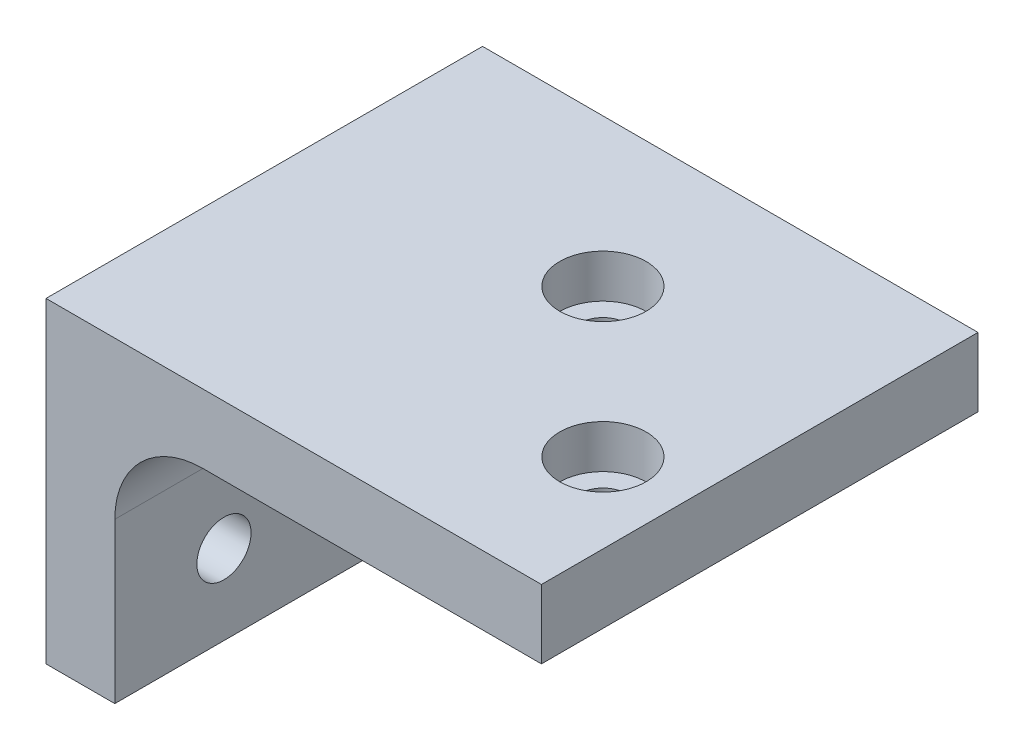
ISO-10303-21;
HEADER;
FILE_DESCRIPTION(('STEP AP214'),'2;1');
FILE_NAME('part.step','',(''),(''),'','','');
FILE_SCHEMA(('AUTOMOTIVE_DESIGN { 1 0 10303 214 1 1 1 1 }'));
ENDSEC;
DATA;
#1=APPLICATION_CONTEXT('core data for automotive mechanical design processes');
#2=APPLICATION_PROTOCOL_DEFINITION('international standard','automotive_design',2000,#1);
#3=PRODUCT_CONTEXT('',#1,'mechanical');
#4=PRODUCT('Part','Part','',(#3));
#5=PRODUCT_RELATED_PRODUCT_CATEGORY('part','',(#4));
#6=PRODUCT_DEFINITION_FORMATION('','',#4);
#7=PRODUCT_DEFINITION_CONTEXT('part definition',#1,'design');
#8=PRODUCT_DEFINITION('design','',#6,#7);
#9=PRODUCT_DEFINITION_SHAPE('','',#8);
#10=(LENGTH_UNIT() NAMED_UNIT(*) SI_UNIT(.MILLI.,.METRE.));
#11=(NAMED_UNIT(*) PLANE_ANGLE_UNIT() SI_UNIT($,.RADIAN.));
#12=(NAMED_UNIT(*) SI_UNIT($,.STERADIAN.) SOLID_ANGLE_UNIT());
#13=UNCERTAINTY_MEASURE_WITH_UNIT(LENGTH_MEASURE(1.E-05),#10,'distance_accuracy_value','');
#14=(GEOMETRIC_REPRESENTATION_CONTEXT(3) GLOBAL_UNCERTAINTY_ASSIGNED_CONTEXT((#13)) GLOBAL_UNIT_ASSIGNED_CONTEXT((#10,
#11,#12)) REPRESENTATION_CONTEXT('',''));
#15=CARTESIAN_POINT('',(0.,0.,0.));
#16=DIRECTION('',(0.,0.,1.));
#17=DIRECTION('',(1.,0.,0.));
#18=AXIS2_PLACEMENT_3D('',#15,#16,#17);
#19=CARTESIAN_POINT('',(34.1337413005797,125.830890044503,-26.657885625662));
#20=DIRECTION('',(0.,-1.,0.));
#21=DIRECTION('',(0.,0.,-1.));
#22=AXIS2_PLACEMENT_3D('',#19,#20,#21);
#23=CYLINDRICAL_SURFACE('',#22,2.13359999999999);
#24=CARTESIAN_POINT('',(34.1337413005797,119.480890044503,-26.657885625662));
#25=DIRECTION('',(0.,-1.,0.));
#26=DIRECTION('',(0.,0.,-1.));
#27=AXIS2_PLACEMENT_3D('',#24,#25,#26);
#28=CIRCLE('',#27,2.13359999999999);
#29=CARTESIAN_POINT('',(34.1337413005797,119.480890044503,-28.791485625662));
#30=VERTEX_POINT('',#29);
#31=EDGE_CURVE('E174',#30,#30,#28,.T.);
#32=ORIENTED_EDGE('',*,*,#31,.T.);
#33=EDGE_LOOP('',(#32));
#34=FACE_BOUND('',#33,.T.);
#35=CARTESIAN_POINT('',(34.1337413005797,121.830890044503,-26.657885625662));
#36=DIRECTION('',(0.,1.,0.));
#37=DIRECTION('',(0.,0.,1.));
#38=AXIS2_PLACEMENT_3D('',#35,#36,#37);
#39=CIRCLE('',#38,2.13359999999999);
#40=CARTESIAN_POINT('',(34.1337413005797,121.830890044503,-24.524285625662));
#41=VERTEX_POINT('',#40);
#42=EDGE_CURVE('E55',#41,#41,#39,.F.);
#43=ORIENTED_EDGE('',*,*,#42,.F.);
#44=EDGE_LOOP('',(#43));
#45=FACE_BOUND('',#44,.T.);
#46=ADVANCED_FACE('F51',(#34,#45),#23,.F.);
#47=CARTESIAN_POINT('',(47.7567898362415,125.830890044503,-13.03483709));
#48=DIRECTION('',(0.,-1.,0.));
#49=DIRECTION('',(0.,0.,-1.));
#50=AXIS2_PLACEMENT_3D('',#47,#48,#49);
#51=CYLINDRICAL_SURFACE('',#50,2.1336);
#52=CARTESIAN_POINT('',(47.7567898362415,119.480890044503,-13.03483709));
#53=DIRECTION('',(0.,-1.,0.));
#54=DIRECTION('',(0.,0.,-1.));
#55=AXIS2_PLACEMENT_3D('',#52,#53,#54);
#56=CIRCLE('',#55,2.1336);
#57=CARTESIAN_POINT('',(47.7567898362415,119.480890044503,-15.16843709));
#58=VERTEX_POINT('',#57);
#59=EDGE_CURVE('E147',#58,#58,#56,.T.);
#60=ORIENTED_EDGE('',*,*,#59,.T.);
#61=EDGE_LOOP('',(#60));
#62=FACE_BOUND('',#61,.T.);
#63=CARTESIAN_POINT('',(47.7567898362415,121.830890044503,-13.03483709));
#64=DIRECTION('',(0.,1.,0.));
#65=DIRECTION('',(0.,0.,1.));
#66=AXIS2_PLACEMENT_3D('',#63,#64,#65);
#67=CIRCLE('',#66,2.1336);
#68=CARTESIAN_POINT('',(47.7567898362415,121.830890044503,-10.90123709));
#69=VERTEX_POINT('',#68);
#70=EDGE_CURVE('E168',#69,#69,#67,.F.);
#71=ORIENTED_EDGE('',*,*,#70,.F.);
#72=EDGE_LOOP('',(#71));
#73=FACE_BOUND('',#72,.T.);
#74=ADVANCED_FACE('F219',(#62,#73),#51,.F.);
#75=CARTESIAN_POINT('',(23.878,111.352890044503,-40.2844));
#76=DIRECTION('',(0.,0.,1.));
#77=DIRECTION('',(1.,0.,0.));
#78=AXIS2_PLACEMENT_3D('',#75,#76,#77);
#79=CYLINDRICAL_SURFACE('',#78,8.128);
#80=CARTESIAN_POINT('',(23.878,111.352890044503,0.));
#81=DIRECTION('',(0.,0.,1.));
#82=DIRECTION('',(1.,0.,0.));
#83=AXIS2_PLACEMENT_3D('',#80,#81,#82);
#84=CIRCLE('',#83,8.128);
#85=CARTESIAN_POINT('',(23.878,119.480890044503,0.));
#86=VERTEX_POINT('',#85);
#87=CARTESIAN_POINT('',(15.75,111.352890044503,0.));
#88=VERTEX_POINT('',#87);
#89=EDGE_CURVE('E144',#86,#88,#84,.T.);
#90=ORIENTED_EDGE('',*,*,#89,.T.);
#91=DIRECTION('',(0.,0.,1.));
#92=VECTOR('',#91,1.);
#93=CARTESIAN_POINT('',(15.75,111.352890044503,-40.2844));
#94=LINE('',#93,#92);
#95=CARTESIAN_POINT('',(15.75,111.352890044503,-40.2844));
#96=VERTEX_POINT('',#95);
#97=EDGE_CURVE('E13',#96,#88,#94,.T.);
#98=ORIENTED_EDGE('',*,*,#97,.F.);
#99=CARTESIAN_POINT('',(23.878,111.352890044503,-40.2844));
#100=DIRECTION('',(0.,0.,1.));
#101=DIRECTION('',(1.,0.,0.));
#102=AXIS2_PLACEMENT_3D('',#99,#100,#101);
#103=CIRCLE('',#102,8.128);
#104=CARTESIAN_POINT('',(23.878,119.480890044503,-40.2844));
#105=VERTEX_POINT('',#104);
#106=EDGE_CURVE('E70',#105,#96,#103,.T.);
#107=ORIENTED_EDGE('',*,*,#106,.F.);
#108=DIRECTION('',(0.,0.,1.));
#109=VECTOR('',#108,1.);
#110=CARTESIAN_POINT('',(23.878,119.480890044503,-40.2844));
#111=LINE('',#110,#109);
#112=EDGE_CURVE('E108',#105,#86,#111,.T.);
#113=ORIENTED_EDGE('',*,*,#112,.T.);
#114=EDGE_LOOP('',(#90,#98,#107,#113));
#115=FACE_BOUND('',#114,.T.);
#116=ADVANCED_FACE('F53',(#115),#79,.F.);
#117=CARTESIAN_POINT('',(15.75,0.,-40.2844));
#118=DIRECTION('',(1.,0.,0.));
#119=DIRECTION('',(0.,0.,-1.));
#120=AXIS2_PLACEMENT_3D('',#117,#118,#119);
#121=PLANE('',#120);
#122=CARTESIAN_POINT('',(15.75,103.986890044503,-10.0711));
#123=DIRECTION('',(1.,0.,0.));
#124=DIRECTION('',(0.,0.,-1.));
#125=AXIS2_PLACEMENT_3D('',#122,#123,#124);
#126=CIRCLE('',#125,2.5);
#127=CARTESIAN_POINT('',(15.75,103.986890044503,-12.5711));
#128=VERTEX_POINT('',#127);
#129=EDGE_CURVE('E350',#128,#128,#126,.T.);
#130=ORIENTED_EDGE('',*,*,#129,.F.);
#131=EDGE_LOOP('',(#130));
#132=FACE_BOUND('',#131,.T.);
#133=CARTESIAN_POINT('',(15.75,103.986890044503,-30.2133));
#134=DIRECTION('',(1.,0.,0.));
#135=DIRECTION('',(0.,0.,-1.));
#136=AXIS2_PLACEMENT_3D('',#133,#134,#135);
#137=CIRCLE('',#136,2.5);
#138=CARTESIAN_POINT('',(15.75,103.986890044503,-32.7133));
#139=VERTEX_POINT('',#138);
#140=EDGE_CURVE('E184',#139,#139,#137,.T.);
#141=ORIENTED_EDGE('',*,*,#140,.F.);
#142=EDGE_LOOP('',(#141));
#143=FACE_BOUND('',#142,.T.);
#144=DIRECTION('',(0.,1.,0.));
#145=VECTOR('',#144,1.);
#146=CARTESIAN_POINT('',(15.75,0.,0.));
#147=LINE('',#146,#145);
#148=CARTESIAN_POINT('',(15.75,96.6208900445025,0.));
#149=VERTEX_POINT('',#148);
#150=EDGE_CURVE('E159',#149,#88,#147,.T.);
#151=ORIENTED_EDGE('',*,*,#150,.F.);
#152=DIRECTION('',(0.,0.,1.));
#153=VECTOR('',#152,1.);
#154=CARTESIAN_POINT('',(15.75,96.6208900445025,-40.2844));
#155=LINE('',#154,#153);
#156=CARTESIAN_POINT('',(15.75,96.6208900445025,-40.2844));
#157=VERTEX_POINT('',#156);
#158=EDGE_CURVE('E61',#157,#149,#155,.T.);
#159=ORIENTED_EDGE('',*,*,#158,.F.);
#160=DIRECTION('',(0.,1.,0.));
#161=VECTOR('',#160,1.);
#162=CARTESIAN_POINT('',(15.75,0.,-40.2844));
#163=LINE('',#162,#161);
#164=EDGE_CURVE('E134',#157,#96,#163,.T.);
#165=ORIENTED_EDGE('',*,*,#164,.T.);
#166=ORIENTED_EDGE('',*,*,#97,.T.);
#167=EDGE_LOOP('',(#151,#159,#165,#166));
#168=FACE_BOUND('',#167,.T.);
#169=ADVANCED_FACE('F210',(#132,#143,#168),#121,.T.);
#170=CARTESIAN_POINT('',(0.,96.6208900445025,-40.2844));
#171=DIRECTION('',(0.,-1.,0.));
#172=DIRECTION('',(0.,0.,-1.));
#173=AXIS2_PLACEMENT_3D('',#170,#171,#172);
#174=PLANE('',#173);
#175=DIRECTION('',(1.,0.,0.));
#176=VECTOR('',#175,1.);
#177=CARTESIAN_POINT('',(0.,96.6208900445025,0.));
#178=LINE('',#177,#176);
#179=CARTESIAN_POINT('',(9.4,96.6208900445025,0.));
#180=VERTEX_POINT('',#179);
#181=EDGE_CURVE('E122',#180,#149,#178,.T.);
#182=ORIENTED_EDGE('',*,*,#181,.F.);
#183=DIRECTION('',(0.,0.,1.));
#184=VECTOR('',#183,1.);
#185=CARTESIAN_POINT('',(9.4,96.6208900445025,-40.2844));
#186=LINE('',#185,#184);
#187=CARTESIAN_POINT('',(9.4,96.6208900445025,-40.2844));
#188=VERTEX_POINT('',#187);
#189=EDGE_CURVE('E118',#188,#180,#186,.T.);
#190=ORIENTED_EDGE('',*,*,#189,.F.);
#191=DIRECTION('',(1.,0.,0.));
#192=VECTOR('',#191,1.);
#193=CARTESIAN_POINT('',(0.,96.6208900445025,-40.2844));
#194=LINE('',#193,#192);
#195=EDGE_CURVE('E121',#188,#157,#194,.T.);
#196=ORIENTED_EDGE('',*,*,#195,.T.);
#197=ORIENTED_EDGE('',*,*,#158,.T.);
#198=EDGE_LOOP('',(#182,#190,#196,#197));
#199=FACE_BOUND('',#198,.T.);
#200=ADVANCED_FACE('F120',(#199),#174,.T.);
#201=CARTESIAN_POINT('',(9.39999999999998,0.,-40.2844));
#202=DIRECTION('',(-1.,0.,0.));
#203=DIRECTION('',(0.,-1.,0.));
#204=AXIS2_PLACEMENT_3D('',#201,#202,#203);
#205=PLANE('',#204);
#206=CARTESIAN_POINT('',(9.4,103.986890044503,-10.0711));
#207=DIRECTION('',(1.,0.,0.));
#208=DIRECTION('',(0.,0.,-1.));
#209=AXIS2_PLACEMENT_3D('',#206,#207,#208);
#210=CIRCLE('',#209,2.5);
#211=CARTESIAN_POINT('',(9.4,103.986890044503,-12.5711));
#212=VERTEX_POINT('',#211);
#213=EDGE_CURVE('E192',#212,#212,#210,.T.);
#214=ORIENTED_EDGE('',*,*,#213,.T.);
#215=EDGE_LOOP('',(#214));
#216=FACE_BOUND('',#215,.T.);
#217=CARTESIAN_POINT('',(9.4,103.986890044503,-30.2133));
#218=DIRECTION('',(1.,0.,0.));
#219=DIRECTION('',(0.,0.,-1.));
#220=AXIS2_PLACEMENT_3D('',#217,#218,#219);
#221=CIRCLE('',#220,2.5);
#222=CARTESIAN_POINT('',(9.4,103.986890044503,-32.7133));
#223=VERTEX_POINT('',#222);
#224=EDGE_CURVE('E351',#223,#223,#221,.T.);
#225=ORIENTED_EDGE('',*,*,#224,.T.);
#226=EDGE_LOOP('',(#225));
#227=FACE_BOUND('',#226,.T.);
#228=DIRECTION('',(0.,-1.,0.));
#229=VECTOR('',#228,1.);
#230=CARTESIAN_POINT('',(9.39999999999998,0.,0.));
#231=LINE('',#230,#229);
#232=CARTESIAN_POINT('',(9.40000000000001,125.830890044503,0.));
#233=VERTEX_POINT('',#232);
#234=EDGE_CURVE('E156',#233,#180,#231,.T.);
#235=ORIENTED_EDGE('',*,*,#234,.F.);
#236=DIRECTION('',(0.,0.,1.));
#237=VECTOR('',#236,1.);
#238=CARTESIAN_POINT('',(9.40000000000001,125.830890044503,-40.2844));
#239=LINE('',#238,#237);
#240=CARTESIAN_POINT('',(9.40000000000001,125.830890044503,-40.2844));
#241=VERTEX_POINT('',#240);
#242=EDGE_CURVE('E127',#241,#233,#239,.T.);
#243=ORIENTED_EDGE('',*,*,#242,.F.);
#244=DIRECTION('',(0.,-1.,0.));
#245=VECTOR('',#244,1.);
#246=CARTESIAN_POINT('',(9.39999999999998,0.,-40.2844));
#247=LINE('',#246,#245);
#248=EDGE_CURVE('E132',#241,#188,#247,.T.);
#249=ORIENTED_EDGE('',*,*,#248,.T.);
#250=ORIENTED_EDGE('',*,*,#189,.T.);
#251=EDGE_LOOP('',(#235,#243,#249,#250));
#252=FACE_BOUND('',#251,.T.);
#253=ADVANCED_FACE('F136',(#216,#227,#252),#205,.T.);
#254=CARTESIAN_POINT('',(0.,125.830890044503,-40.2844));
#255=DIRECTION('',(0.,1.,0.));
#256=DIRECTION('',(0.,0.,1.));
#257=AXIS2_PLACEMENT_3D('',#254,#255,#256);
#258=PLANE('',#257);
#259=CARTESIAN_POINT('',(47.7567898362415,125.830890044503,-13.03483709));
#260=DIRECTION('',(0.,1.,0.));
#261=DIRECTION('',(0.,0.,1.));
#262=AXIS2_PLACEMENT_3D('',#259,#260,#261);
#263=CIRCLE('',#262,3.9878);
#264=CARTESIAN_POINT('',(47.7567898362415,125.830890044503,-9.04703709));
#265=VERTEX_POINT('',#264);
#266=EDGE_CURVE('E176',#265,#265,#263,.T.);
#267=ORIENTED_EDGE('',*,*,#266,.F.);
#268=EDGE_LOOP('',(#267));
#269=FACE_BOUND('',#268,.T.);
#270=CARTESIAN_POINT('',(34.1337413005797,125.830890044503,-26.657885625662));
#271=DIRECTION('',(0.,1.,0.));
#272=DIRECTION('',(0.,0.,1.));
#273=AXIS2_PLACEMENT_3D('',#270,#271,#272);
#274=CIRCLE('',#273,3.9878);
#275=CARTESIAN_POINT('',(34.1337413005797,125.830890044503,-22.670085625662));
#276=VERTEX_POINT('',#275);
#277=EDGE_CURVE('E189',#276,#276,#274,.T.);
#278=ORIENTED_EDGE('',*,*,#277,.F.);
#279=EDGE_LOOP('',(#278));
#280=FACE_BOUND('',#279,.T.);
#281=DIRECTION('',(-1.,0.,0.));
#282=VECTOR('',#281,1.);
#283=CARTESIAN_POINT('',(0.,125.830890044503,0.));
#284=LINE('',#283,#282);
#285=CARTESIAN_POINT('',(55.12,125.830890044503,0.));
#286=VERTEX_POINT('',#285);
#287=EDGE_CURVE('E153',#286,#233,#284,.T.);
#288=ORIENTED_EDGE('',*,*,#287,.F.);
#289=DIRECTION('',(0.,0.,1.));
#290=VECTOR('',#289,1.);
#291=CARTESIAN_POINT('',(55.12,125.830890044503,-40.2844));
#292=LINE('',#291,#290);
#293=CARTESIAN_POINT('',(55.12,125.830890044503,-40.2844));
#294=VERTEX_POINT('',#293);
#295=EDGE_CURVE('E164',#294,#286,#292,.T.);
#296=ORIENTED_EDGE('',*,*,#295,.F.);
#297=DIRECTION('',(-1.,0.,0.));
#298=VECTOR('',#297,1.);
#299=CARTESIAN_POINT('',(0.,125.830890044503,-40.2844));
#300=LINE('',#299,#298);
#301=EDGE_CURVE('E137',#294,#241,#300,.T.);
#302=ORIENTED_EDGE('',*,*,#301,.T.);
#303=ORIENTED_EDGE('',*,*,#242,.T.);
#304=EDGE_LOOP('',(#288,#296,#302,#303));
#305=FACE_BOUND('',#304,.T.);
#306=ADVANCED_FACE('F266',(#269,#280,#305),#258,.T.);
#307=CARTESIAN_POINT('',(55.12,0.,-40.2844));
#308=DIRECTION('',(1.,0.,0.));
#309=DIRECTION('',(0.,0.,-1.));
#310=AXIS2_PLACEMENT_3D('',#307,#308,#309);
#311=PLANE('',#310);
#312=DIRECTION('',(0.,1.,0.));
#313=VECTOR('',#312,1.);
#314=CARTESIAN_POINT('',(55.12,0.,0.));
#315=LINE('',#314,#313);
#316=CARTESIAN_POINT('',(55.12,119.480890044503,0.));
#317=VERTEX_POINT('',#316);
#318=EDGE_CURVE('E150',#317,#286,#315,.T.);
#319=ORIENTED_EDGE('',*,*,#318,.F.);
#320=DIRECTION('',(0.,0.,1.));
#321=VECTOR('',#320,1.);
#322=CARTESIAN_POINT('',(55.12,119.480890044503,-40.2844));
#323=LINE('',#322,#321);
#324=CARTESIAN_POINT('',(55.12,119.480890044503,-40.2844));
#325=VERTEX_POINT('',#324);
#326=EDGE_CURVE('E166',#325,#317,#323,.T.);
#327=ORIENTED_EDGE('',*,*,#326,.F.);
#328=DIRECTION('',(0.,1.,0.));
#329=VECTOR('',#328,1.);
#330=CARTESIAN_POINT('',(55.12,0.,-40.2844));
#331=LINE('',#330,#329);
#332=EDGE_CURVE('E139',#325,#294,#331,.T.);
#333=ORIENTED_EDGE('',*,*,#332,.T.);
#334=ORIENTED_EDGE('',*,*,#295,.T.);
#335=EDGE_LOOP('',(#319,#327,#333,#334));
#336=FACE_BOUND('',#335,.T.);
#337=ADVANCED_FACE('F203',(#336),#311,.T.);
#338=CARTESIAN_POINT('',(0.,119.480890044503,-40.2844));
#339=DIRECTION('',(0.,-1.,0.));
#340=DIRECTION('',(0.,0.,-1.));
#341=AXIS2_PLACEMENT_3D('',#338,#339,#340);
#342=PLANE('',#341);
#343=ORIENTED_EDGE('',*,*,#59,.F.);
#344=EDGE_LOOP('',(#343));
#345=FACE_BOUND('',#344,.T.);
#346=ORIENTED_EDGE('',*,*,#31,.F.);
#347=EDGE_LOOP('',(#346));
#348=FACE_BOUND('',#347,.T.);
#349=DIRECTION('',(1.,0.,0.));
#350=VECTOR('',#349,1.);
#351=CARTESIAN_POINT('',(0.,119.480890044503,0.));
#352=LINE('',#351,#350);
#353=EDGE_CURVE('E146',#86,#317,#352,.T.);
#354=ORIENTED_EDGE('',*,*,#353,.F.);
#355=ORIENTED_EDGE('',*,*,#112,.F.);
#356=DIRECTION('',(1.,0.,0.));
#357=VECTOR('',#356,1.);
#358=CARTESIAN_POINT('',(0.,119.480890044503,-40.2844));
#359=LINE('',#358,#357);
#360=EDGE_CURVE('E198',#105,#325,#359,.T.);
#361=ORIENTED_EDGE('',*,*,#360,.T.);
#362=ORIENTED_EDGE('',*,*,#326,.T.);
#363=EDGE_LOOP('',(#354,#355,#361,#362));
#364=FACE_BOUND('',#363,.T.);
#365=ADVANCED_FACE('F205',(#345,#348,#364),#342,.T.);
#366=CARTESIAN_POINT('',(0.,0.,-40.2844));
#367=DIRECTION('',(0.,0.,1.));
#368=DIRECTION('',(1.,0.,0.));
#369=AXIS2_PLACEMENT_3D('',#366,#367,#368);
#370=PLANE('',#369);
#371=ORIENTED_EDGE('',*,*,#106,.T.);
#372=ORIENTED_EDGE('',*,*,#164,.F.);
#373=ORIENTED_EDGE('',*,*,#195,.F.);
#374=ORIENTED_EDGE('',*,*,#248,.F.);
#375=ORIENTED_EDGE('',*,*,#301,.F.);
#376=ORIENTED_EDGE('',*,*,#332,.F.);
#377=ORIENTED_EDGE('',*,*,#360,.F.);
#378=EDGE_LOOP('',(#371,#372,#373,#374,#375,#376,#377));
#379=FACE_BOUND('',#378,.T.);
#380=ADVANCED_FACE('F130',(#379),#370,.F.);
#381=CARTESIAN_POINT('',(0.,0.,0.));
#382=DIRECTION('',(0.,0.,1.));
#383=DIRECTION('',(1.,0.,0.));
#384=AXIS2_PLACEMENT_3D('',#381,#382,#383);
#385=PLANE('',#384);
#386=ORIENTED_EDGE('',*,*,#89,.F.);
#387=ORIENTED_EDGE('',*,*,#353,.T.);
#388=ORIENTED_EDGE('',*,*,#318,.T.);
#389=ORIENTED_EDGE('',*,*,#287,.T.);
#390=ORIENTED_EDGE('',*,*,#234,.T.);
#391=ORIENTED_EDGE('',*,*,#181,.T.);
#392=ORIENTED_EDGE('',*,*,#150,.T.);
#393=EDGE_LOOP('',(#386,#387,#388,#389,#390,#391,#392));
#394=FACE_BOUND('',#393,.T.);
#395=ADVANCED_FACE('F208',(#394),#385,.T.);
#396=CARTESIAN_POINT('',(47.7567898362415,121.830890044503,-13.03483709));
#397=DIRECTION('',(0.,1.,0.));
#398=DIRECTION('',(0.,0.,1.));
#399=AXIS2_PLACEMENT_3D('',#396,#397,#398);
#400=PLANE('',#399);
#401=CARTESIAN_POINT('',(47.7567898362415,121.830890044503,-13.03483709));
#402=DIRECTION('',(0.,1.,0.));
#403=DIRECTION('',(0.,0.,1.));
#404=AXIS2_PLACEMENT_3D('',#401,#402,#403);
#405=CIRCLE('',#404,3.9878);
#406=CARTESIAN_POINT('',(47.7567898362415,121.830890044503,-9.04703709));
#407=VERTEX_POINT('',#406);
#408=EDGE_CURVE('E170',#407,#407,#405,.T.);
#409=ORIENTED_EDGE('',*,*,#408,.T.);
#410=EDGE_LOOP('',(#409));
#411=FACE_BOUND('',#410,.T.);
#412=ORIENTED_EDGE('',*,*,#70,.T.);
#413=EDGE_LOOP('',(#412));
#414=FACE_BOUND('',#413,.T.);
#415=ADVANCED_FACE('F236',(#411,#414),#400,.T.);
#416=CARTESIAN_POINT('',(47.7567898362415,121.830890044503,-13.03483709));
#417=DIRECTION('',(0.,1.,0.));
#418=DIRECTION('',(0.,0.,1.));
#419=AXIS2_PLACEMENT_3D('',#416,#417,#418);
#420=CYLINDRICAL_SURFACE('',#419,3.9878);
#421=ORIENTED_EDGE('',*,*,#408,.F.);
#422=EDGE_LOOP('',(#421));
#423=FACE_BOUND('',#422,.T.);
#424=ORIENTED_EDGE('',*,*,#266,.T.);
#425=EDGE_LOOP('',(#424));
#426=FACE_BOUND('',#425,.T.);
#427=ADVANCED_FACE('F240',(#423,#426),#420,.F.);
#428=CARTESIAN_POINT('',(34.1337413005797,121.830890044503,-26.657885625662));
#429=DIRECTION('',(0.,1.,0.));
#430=DIRECTION('',(0.,0.,1.));
#431=AXIS2_PLACEMENT_3D('',#428,#429,#430);
#432=PLANE('',#431);
#433=CARTESIAN_POINT('',(34.1337413005797,121.830890044503,-26.657885625662));
#434=DIRECTION('',(0.,1.,0.));
#435=DIRECTION('',(0.,0.,1.));
#436=AXIS2_PLACEMENT_3D('',#433,#434,#435);
#437=CIRCLE('',#436,3.9878);
#438=CARTESIAN_POINT('',(34.1337413005797,121.830890044503,-22.670085625662));
#439=VERTEX_POINT('',#438);
#440=EDGE_CURVE('E181',#439,#439,#437,.T.);
#441=ORIENTED_EDGE('',*,*,#440,.T.);
#442=EDGE_LOOP('',(#441));
#443=FACE_BOUND('',#442,.T.);
#444=ORIENTED_EDGE('',*,*,#42,.T.);
#445=EDGE_LOOP('',(#444));
#446=FACE_BOUND('',#445,.T.);
#447=ADVANCED_FACE('F245',(#443,#446),#432,.T.);
#448=CARTESIAN_POINT('',(34.1337413005797,121.830890044503,-26.657885625662));
#449=DIRECTION('',(0.,1.,0.));
#450=DIRECTION('',(0.,0.,1.));
#451=AXIS2_PLACEMENT_3D('',#448,#449,#450);
#452=CYLINDRICAL_SURFACE('',#451,3.9878);
#453=ORIENTED_EDGE('',*,*,#440,.F.);
#454=EDGE_LOOP('',(#453));
#455=FACE_BOUND('',#454,.T.);
#456=ORIENTED_EDGE('',*,*,#277,.T.);
#457=EDGE_LOOP('',(#456));
#458=FACE_BOUND('',#457,.T.);
#459=ADVANCED_FACE('F253',(#455,#458),#452,.F.);
#460=CARTESIAN_POINT('',(9.4,103.986890044503,-30.2133));
#461=DIRECTION('',(1.,0.,0.));
#462=DIRECTION('',(0.,0.,-1.));
#463=AXIS2_PLACEMENT_3D('',#460,#461,#462);
#464=CYLINDRICAL_SURFACE('',#463,2.5);
#465=ORIENTED_EDGE('',*,*,#224,.F.);
#466=EDGE_LOOP('',(#465));
#467=FACE_BOUND('',#466,.T.);
#468=ORIENTED_EDGE('',*,*,#140,.T.);
#469=EDGE_LOOP('',(#468));
#470=FACE_BOUND('',#469,.T.);
#471=ADVANCED_FACE('F249',(#467,#470),#464,.F.);
#472=CARTESIAN_POINT('',(9.4,103.986890044503,-10.0711));
#473=DIRECTION('',(1.,0.,0.));
#474=DIRECTION('',(0.,0.,-1.));
#475=AXIS2_PLACEMENT_3D('',#472,#473,#474);
#476=CYLINDRICAL_SURFACE('',#475,2.5);
#477=ORIENTED_EDGE('',*,*,#213,.F.);
#478=EDGE_LOOP('',(#477));
#479=FACE_BOUND('',#478,.T.);
#480=ORIENTED_EDGE('',*,*,#129,.T.);
#481=EDGE_LOOP('',(#480));
#482=FACE_BOUND('',#481,.T.);
#483=ADVANCED_FACE('F260',(#479,#482),#476,.F.);
#484=CLOSED_SHELL('',(#46,#74,#116,#169,#200,#253,#306,#337,#365,#380,#395,#415,#427,#447,#459,
#471,#483));
#485=MANIFOLD_SOLID_BREP('B2',#484);
#486=ADVANCED_BREP_SHAPE_REPRESENTATION('',(#18,#485),#14);
#487=SHAPE_DEFINITION_REPRESENTATION(#9,#486);
ENDSEC;
END-ISO-10303-21;
